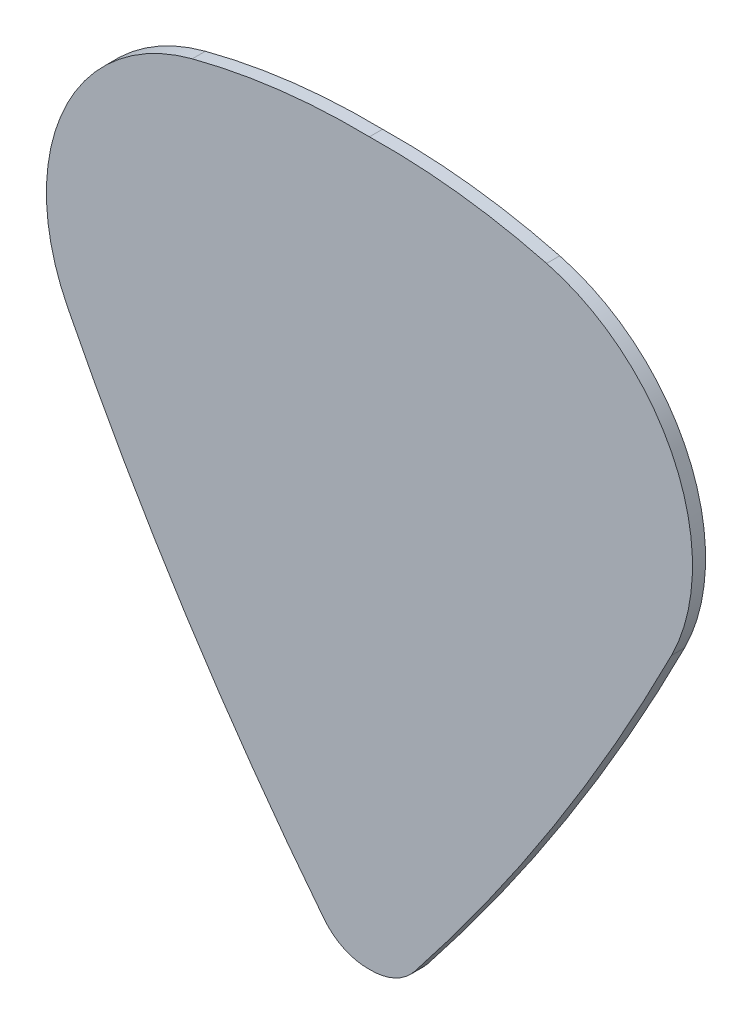
ISO-10303-21;
HEADER;
FILE_DESCRIPTION(('STEP AP214'),'2;1');
FILE_NAME('part.step','',(''),(''),'','','');
FILE_SCHEMA(('AUTOMOTIVE_DESIGN { 1 0 10303 214 1 1 1 1 }'));
ENDSEC;
DATA;
#1=APPLICATION_CONTEXT('core data for automotive mechanical design processes');
#2=APPLICATION_PROTOCOL_DEFINITION('international standard','automotive_design',2000,#1);
#3=PRODUCT_CONTEXT('',#1,'mechanical');
#4=PRODUCT('Part','Part','',(#3));
#5=PRODUCT_RELATED_PRODUCT_CATEGORY('part','',(#4));
#6=PRODUCT_DEFINITION_FORMATION('','',#4);
#7=PRODUCT_DEFINITION_CONTEXT('part definition',#1,'design');
#8=PRODUCT_DEFINITION('design','',#6,#7);
#9=PRODUCT_DEFINITION_SHAPE('','',#8);
#10=(LENGTH_UNIT() NAMED_UNIT(*) SI_UNIT(.MILLI.,.METRE.));
#11=(NAMED_UNIT(*) PLANE_ANGLE_UNIT() SI_UNIT($,.RADIAN.));
#12=(NAMED_UNIT(*) SI_UNIT($,.STERADIAN.) SOLID_ANGLE_UNIT());
#13=UNCERTAINTY_MEASURE_WITH_UNIT(LENGTH_MEASURE(1.E-05),#10,'distance_accuracy_value','');
#14=(GEOMETRIC_REPRESENTATION_CONTEXT(3) GLOBAL_UNCERTAINTY_ASSIGNED_CONTEXT((#13)) GLOBAL_UNIT_ASSIGNED_CONTEXT((#10,
#11,#12)) REPRESENTATION_CONTEXT('',''));
#15=CARTESIAN_POINT('',(0.,0.,0.));
#16=DIRECTION('',(0.,0.,1.));
#17=DIRECTION('',(1.,0.,0.));
#18=AXIS2_PLACEMENT_3D('',#15,#16,#17);
#19=CARTESIAN_POINT('',(0.583389971777569,-13.555034713092,0.6));
#20=DIRECTION('',(0.,0.,-1.));
#21=DIRECTION('',(-1.,0.,0.));
#22=AXIS2_PLACEMENT_3D('',#19,#20,#21);
#23=CYLINDRICAL_SURFACE('',#22,29.7180994700104);
#24=CARTESIAN_POINT('',(0.583389971777569,-13.555034713092,0.));
#25=DIRECTION('',(0.,0.,1.));
#26=DIRECTION('',(1.,0.,0.));
#27=AXIS2_PLACEMENT_3D('',#24,#25,#26);
#28=CIRCLE('',#27,29.7180994700104);
#29=CARTESIAN_POINT('',(8.10642740287265,15.1950843113533,0.));
#30=VERTEX_POINT('',#29);
#31=CARTESIAN_POINT('',(0.,16.1573380001442,0.));
#32=VERTEX_POINT('',#31);
#33=EDGE_CURVE('E128',#30,#32,#28,.T.);
#34=ORIENTED_EDGE('',*,*,#33,.T.);
#35=DIRECTION('',(0.,0.,-1.));
#36=VECTOR('',#35,1.);
#37=CARTESIAN_POINT('',(0.,16.1573380001442,0.6));
#38=LINE('',#37,#36);
#39=CARTESIAN_POINT('',(0.,16.1573380001442,0.6));
#40=VERTEX_POINT('',#39);
#41=EDGE_CURVE('E11',#40,#32,#38,.T.);
#42=ORIENTED_EDGE('',*,*,#41,.F.);
#43=CARTESIAN_POINT('',(0.583389971777569,-13.555034713092,0.6));
#44=DIRECTION('',(0.,0.,1.));
#45=DIRECTION('',(1.,0.,0.));
#46=AXIS2_PLACEMENT_3D('',#43,#44,#45);
#47=CIRCLE('',#46,29.7180994700104);
#48=CARTESIAN_POINT('',(8.10642740287265,15.1950843113533,0.6));
#49=VERTEX_POINT('',#48);
#50=EDGE_CURVE('E142',#49,#40,#47,.T.);
#51=ORIENTED_EDGE('',*,*,#50,.F.);
#52=DIRECTION('',(0.,0.,-1.));
#53=VECTOR('',#52,1.);
#54=CARTESIAN_POINT('',(8.10642740287265,15.1950843113533,0.6));
#55=LINE('',#54,#53);
#56=EDGE_CURVE('E124',#49,#30,#55,.T.);
#57=ORIENTED_EDGE('',*,*,#56,.T.);
#58=EDGE_LOOP('',(#34,#42,#51,#57));
#59=FACE_BOUND('',#58,.T.);
#60=ADVANCED_FACE('F32',(#59),#23,.T.);
#61=CARTESIAN_POINT('',(-0.583389971777569,-13.555034713092,0.6));
#62=DIRECTION('',(0.,0.,-1.));
#63=DIRECTION('',(-1.,0.,0.));
#64=AXIS2_PLACEMENT_3D('',#61,#62,#63);
#65=CYLINDRICAL_SURFACE('',#64,29.7180994700104);
#66=CARTESIAN_POINT('',(-0.583389971777569,-13.555034713092,0.));
#67=DIRECTION('',(0.,0.,1.));
#68=DIRECTION('',(-1.,0.,0.));
#69=AXIS2_PLACEMENT_3D('',#66,#67,#68);
#70=CIRCLE('',#69,29.7180994700104);
#71=CARTESIAN_POINT('',(-8.10642740287265,15.1950843113533,0.));
#72=VERTEX_POINT('',#71);
#73=EDGE_CURVE('E131',#32,#72,#70,.T.);
#74=ORIENTED_EDGE('',*,*,#73,.T.);
#75=DIRECTION('',(0.,0.,-1.));
#76=VECTOR('',#75,1.);
#77=CARTESIAN_POINT('',(-8.10642740287265,15.1950843113533,0.6));
#78=LINE('',#77,#76);
#79=CARTESIAN_POINT('',(-8.10642740287265,15.1950843113533,0.6));
#80=VERTEX_POINT('',#79);
#81=EDGE_CURVE('E40',#80,#72,#78,.T.);
#82=ORIENTED_EDGE('',*,*,#81,.F.);
#83=CARTESIAN_POINT('',(-0.583389971777569,-13.555034713092,0.6));
#84=DIRECTION('',(0.,0.,1.));
#85=DIRECTION('',(-1.,0.,0.));
#86=AXIS2_PLACEMENT_3D('',#83,#84,#85);
#87=CIRCLE('',#86,29.7180994700104);
#88=EDGE_CURVE('E91',#40,#80,#87,.T.);
#89=ORIENTED_EDGE('',*,*,#88,.F.);
#90=ORIENTED_EDGE('',*,*,#41,.T.);
#91=EDGE_LOOP('',(#74,#82,#89,#90));
#92=FACE_BOUND('',#91,.T.);
#93=ADVANCED_FACE('F177',(#92),#65,.T.);
#94=CARTESIAN_POINT('',(-5.84400110519622,6.54897216077692,0.6));
#95=DIRECTION('',(0.,0.,-1.));
#96=DIRECTION('',(-1.,0.,0.));
#97=AXIS2_PLACEMENT_3D('',#94,#95,#96);
#98=CYLINDRICAL_SURFACE('',#97,8.93721590165321);
#99=CARTESIAN_POINT('',(-5.84400110519622,6.54897216077692,0.));
#100=DIRECTION('',(0.,0.,1.));
#101=DIRECTION('',(-1.,0.,0.));
#102=AXIS2_PLACEMENT_3D('',#99,#100,#101);
#103=CIRCLE('',#102,8.93721590165321);
#104=CARTESIAN_POINT('',(-13.8206795806225,2.51828629204009,0.));
#105=VERTEX_POINT('',#104);
#106=EDGE_CURVE('E133',#72,#105,#103,.T.);
#107=ORIENTED_EDGE('',*,*,#106,.T.);
#108=DIRECTION('',(0.,0.,-1.));
#109=VECTOR('',#108,1.);
#110=CARTESIAN_POINT('',(-13.8206795806225,2.51828629204009,0.6));
#111=LINE('',#110,#109);
#112=CARTESIAN_POINT('',(-13.8206795806225,2.51828629204009,0.6));
#113=VERTEX_POINT('',#112);
#114=EDGE_CURVE('E149',#113,#105,#111,.T.);
#115=ORIENTED_EDGE('',*,*,#114,.F.);
#116=CARTESIAN_POINT('',(-5.84400110519622,6.54897216077692,0.6));
#117=DIRECTION('',(0.,0.,1.));
#118=DIRECTION('',(-1.,0.,0.));
#119=AXIS2_PLACEMENT_3D('',#116,#117,#118);
#120=CIRCLE('',#119,8.93721590165321);
#121=EDGE_CURVE('E157',#80,#113,#120,.T.);
#122=ORIENTED_EDGE('',*,*,#121,.F.);
#123=ORIENTED_EDGE('',*,*,#81,.T.);
#124=EDGE_LOOP('',(#107,#115,#122,#123));
#125=FACE_BOUND('',#124,.T.);
#126=ADVANCED_FACE('F155',(#125),#98,.T.);
#127=CARTESIAN_POINT('',(83.1995989065753,51.5434872806461,0.6));
#128=DIRECTION('',(0.,0.,-1.));
#129=DIRECTION('',(-1.,0.,0.));
#130=AXIS2_PLACEMENT_3D('',#127,#128,#129);
#131=CYLINDRICAL_SURFACE('',#130,108.703287759417);
#132=CARTESIAN_POINT('',(83.1995989065753,51.5434872806461,0.));
#133=DIRECTION('',(0.,0.,1.));
#134=DIRECTION('',(1.,0.,0.));
#135=AXIS2_PLACEMENT_3D('',#132,#133,#134);
#136=CIRCLE('',#135,108.703287759417);
#137=CARTESIAN_POINT('',(-2.07422362726388,-15.8714959217098,0.));
#138=VERTEX_POINT('',#137);
#139=EDGE_CURVE('E135',#105,#138,#136,.T.);
#140=ORIENTED_EDGE('',*,*,#139,.T.);
#141=DIRECTION('',(0.,0.,-1.));
#142=VECTOR('',#141,1.);
#143=CARTESIAN_POINT('',(-2.07422362726388,-15.8714959217098,0.6));
#144=LINE('',#143,#142);
#145=CARTESIAN_POINT('',(-2.07422362726388,-15.8714959217098,0.6));
#146=VERTEX_POINT('',#145);
#147=EDGE_CURVE('E146',#146,#138,#144,.T.);
#148=ORIENTED_EDGE('',*,*,#147,.F.);
#149=CARTESIAN_POINT('',(83.1995989065753,51.5434872806461,0.6));
#150=DIRECTION('',(0.,0.,1.));
#151=DIRECTION('',(1.,0.,0.));
#152=AXIS2_PLACEMENT_3D('',#149,#150,#151);
#153=CIRCLE('',#152,108.703287759417);
#154=EDGE_CURVE('E169',#113,#146,#153,.T.);
#155=ORIENTED_EDGE('',*,*,#154,.F.);
#156=ORIENTED_EDGE('',*,*,#114,.T.);
#157=EDGE_LOOP('',(#140,#148,#155,#156));
#158=FACE_BOUND('',#157,.T.);
#159=ADVANCED_FACE('F165',(#158),#131,.T.);
#160=CARTESIAN_POINT('',(-0.0816849129305678,-14.2962532509181,0.6));
#161=DIRECTION('',(0.,0.,-1.));
#162=DIRECTION('',(-1.,0.,0.));
#163=AXIS2_PLACEMENT_3D('',#160,#161,#162);
#164=CYLINDRICAL_SURFACE('',#163,2.54);
#165=CARTESIAN_POINT('',(-0.0816849129305678,-14.2962532509181,0.));
#166=DIRECTION('',(0.,0.,1.));
#167=DIRECTION('',(1.,0.,0.));
#168=AXIS2_PLACEMENT_3D('',#165,#166,#167);
#169=CIRCLE('',#168,2.54);
#170=CARTESIAN_POINT('',(0.,-16.8349394416474,0.));
#171=VERTEX_POINT('',#170);
#172=EDGE_CURVE('E137',#138,#171,#169,.T.);
#173=ORIENTED_EDGE('',*,*,#172,.T.);
#174=DIRECTION('',(0.,0.,-1.));
#175=VECTOR('',#174,1.);
#176=CARTESIAN_POINT('',(0.,-16.8349394416474,0.6));
#177=LINE('',#176,#175);
#178=CARTESIAN_POINT('',(0.,-16.8349394416474,0.6));
#179=VERTEX_POINT('',#178);
#180=EDGE_CURVE('E119',#179,#171,#177,.T.);
#181=ORIENTED_EDGE('',*,*,#180,.F.);
#182=CARTESIAN_POINT('',(-0.0816849129305678,-14.2962532509181,0.6));
#183=DIRECTION('',(0.,0.,1.));
#184=DIRECTION('',(1.,0.,0.));
#185=AXIS2_PLACEMENT_3D('',#182,#183,#184);
#186=CIRCLE('',#185,2.54);
#187=EDGE_CURVE('E110',#146,#179,#186,.T.);
#188=ORIENTED_EDGE('',*,*,#187,.F.);
#189=ORIENTED_EDGE('',*,*,#147,.T.);
#190=EDGE_LOOP('',(#173,#181,#188,#189));
#191=FACE_BOUND('',#190,.T.);
#192=ADVANCED_FACE('F168',(#191),#164,.T.);
#193=CARTESIAN_POINT('',(0.0816849129305678,-14.2962532509181,0.6));
#194=DIRECTION('',(0.,0.,-1.));
#195=DIRECTION('',(-1.,0.,0.));
#196=AXIS2_PLACEMENT_3D('',#193,#194,#195);
#197=CYLINDRICAL_SURFACE('',#196,2.54);
#198=CARTESIAN_POINT('',(0.0816849129305678,-14.2962532509181,0.));
#199=DIRECTION('',(0.,0.,1.));
#200=DIRECTION('',(-1.,0.,0.));
#201=AXIS2_PLACEMENT_3D('',#198,#199,#200);
#202=CIRCLE('',#201,2.54);
#203=CARTESIAN_POINT('',(2.07422362726387,-15.8714959217098,0.));
#204=VERTEX_POINT('',#203);
#205=EDGE_CURVE('E118',#171,#204,#202,.T.);
#206=ORIENTED_EDGE('',*,*,#205,.T.);
#207=DIRECTION('',(0.,0.,-1.));
#208=VECTOR('',#207,1.);
#209=CARTESIAN_POINT('',(2.07422362726387,-15.8714959217098,0.6));
#210=LINE('',#209,#208);
#211=CARTESIAN_POINT('',(2.07422362726387,-15.8714959217098,0.6));
#212=VERTEX_POINT('',#211);
#213=EDGE_CURVE('E115',#212,#204,#210,.T.);
#214=ORIENTED_EDGE('',*,*,#213,.F.);
#215=CARTESIAN_POINT('',(0.0816849129305678,-14.2962532509181,0.6));
#216=DIRECTION('',(0.,0.,1.));
#217=DIRECTION('',(-1.,0.,0.));
#218=AXIS2_PLACEMENT_3D('',#215,#216,#217);
#219=CIRCLE('',#218,2.54);
#220=EDGE_CURVE('E104',#179,#212,#219,.T.);
#221=ORIENTED_EDGE('',*,*,#220,.F.);
#222=ORIENTED_EDGE('',*,*,#180,.T.);
#223=EDGE_LOOP('',(#206,#214,#221,#222));
#224=FACE_BOUND('',#223,.T.);
#225=ADVANCED_FACE('F116',(#224),#197,.T.);
#226=CARTESIAN_POINT('',(-83.1995989065753,51.5434872806461,0.6));
#227=DIRECTION('',(0.,0.,-1.));
#228=DIRECTION('',(-1.,0.,0.));
#229=AXIS2_PLACEMENT_3D('',#226,#227,#228);
#230=CYLINDRICAL_SURFACE('',#229,108.703287759417);
#231=CARTESIAN_POINT('',(-83.1995989065753,51.5434872806461,0.));
#232=DIRECTION('',(0.,0.,1.));
#233=DIRECTION('',(-1.,0.,0.));
#234=AXIS2_PLACEMENT_3D('',#231,#232,#233);
#235=CIRCLE('',#234,108.703287759417);
#236=CARTESIAN_POINT('',(13.8206795806225,2.51828629204013,0.));
#237=VERTEX_POINT('',#236);
#238=EDGE_CURVE('E77',#204,#237,#235,.T.);
#239=ORIENTED_EDGE('',*,*,#238,.T.);
#240=DIRECTION('',(0.,0.,-1.));
#241=VECTOR('',#240,1.);
#242=CARTESIAN_POINT('',(13.8206795806225,2.51828629204013,0.6));
#243=LINE('',#242,#241);
#244=CARTESIAN_POINT('',(13.8206795806225,2.51828629204013,0.6));
#245=VERTEX_POINT('',#244);
#246=EDGE_CURVE('E120',#245,#237,#243,.T.);
#247=ORIENTED_EDGE('',*,*,#246,.F.);
#248=CARTESIAN_POINT('',(-83.1995989065753,51.5434872806461,0.6));
#249=DIRECTION('',(0.,0.,1.));
#250=DIRECTION('',(-1.,0.,0.));
#251=AXIS2_PLACEMENT_3D('',#248,#249,#250);
#252=CIRCLE('',#251,108.703287759417);
#253=EDGE_CURVE('E108',#212,#245,#252,.T.);
#254=ORIENTED_EDGE('',*,*,#253,.F.);
#255=ORIENTED_EDGE('',*,*,#213,.T.);
#256=EDGE_LOOP('',(#239,#247,#254,#255));
#257=FACE_BOUND('',#256,.T.);
#258=ADVANCED_FACE('F122',(#257),#230,.T.);
#259=CARTESIAN_POINT('',(5.84400110519622,6.54897216077692,0.6));
#260=DIRECTION('',(0.,0.,-1.));
#261=DIRECTION('',(-1.,0.,0.));
#262=AXIS2_PLACEMENT_3D('',#259,#260,#261);
#263=CYLINDRICAL_SURFACE('',#262,8.93721590165321);
#264=CARTESIAN_POINT('',(5.84400110519622,6.54897216077692,0.));
#265=DIRECTION('',(0.,0.,1.));
#266=DIRECTION('',(1.,0.,0.));
#267=AXIS2_PLACEMENT_3D('',#264,#265,#266);
#268=CIRCLE('',#267,8.93721590165321);
#269=EDGE_CURVE('E83',#237,#30,#268,.T.);
#270=ORIENTED_EDGE('',*,*,#269,.T.);
#271=ORIENTED_EDGE('',*,*,#56,.F.);
#272=CARTESIAN_POINT('',(5.84400110519622,6.54897216077692,0.6));
#273=DIRECTION('',(0.,0.,1.));
#274=DIRECTION('',(1.,0.,0.));
#275=AXIS2_PLACEMENT_3D('',#272,#273,#274);
#276=CIRCLE('',#275,8.93721590165321);
#277=EDGE_CURVE('E48',#245,#49,#276,.T.);
#278=ORIENTED_EDGE('',*,*,#277,.F.);
#279=ORIENTED_EDGE('',*,*,#246,.T.);
#280=EDGE_LOOP('',(#270,#271,#278,#279));
#281=FACE_BOUND('',#280,.T.);
#282=ADVANCED_FACE('F193',(#281),#263,.T.);
#283=CARTESIAN_POINT('',(0.,-13.555034713092,0.6));
#284=DIRECTION('',(0.,0.,1.));
#285=DIRECTION('',(1.,0.,0.));
#286=AXIS2_PLACEMENT_3D('',#283,#284,#285);
#287=PLANE('',#286);
#288=ORIENTED_EDGE('',*,*,#50,.T.);
#289=ORIENTED_EDGE('',*,*,#88,.T.);
#290=ORIENTED_EDGE('',*,*,#121,.T.);
#291=ORIENTED_EDGE('',*,*,#154,.T.);
#292=ORIENTED_EDGE('',*,*,#187,.T.);
#293=ORIENTED_EDGE('',*,*,#220,.T.);
#294=ORIENTED_EDGE('',*,*,#253,.T.);
#295=ORIENTED_EDGE('',*,*,#277,.T.);
#296=EDGE_LOOP('',(#288,#289,#290,#291,#292,#293,#294,#295));
#297=FACE_BOUND('',#296,.T.);
#298=ADVANCED_FACE('F106',(#297),#287,.T.);
#299=CARTESIAN_POINT('',(0.,-13.555034713092,0.));
#300=DIRECTION('',(0.,0.,1.));
#301=DIRECTION('',(1.,0.,0.));
#302=AXIS2_PLACEMENT_3D('',#299,#300,#301);
#303=PLANE('',#302);
#304=ORIENTED_EDGE('',*,*,#33,.F.);
#305=ORIENTED_EDGE('',*,*,#269,.F.);
#306=ORIENTED_EDGE('',*,*,#238,.F.);
#307=ORIENTED_EDGE('',*,*,#205,.F.);
#308=ORIENTED_EDGE('',*,*,#172,.F.);
#309=ORIENTED_EDGE('',*,*,#139,.F.);
#310=ORIENTED_EDGE('',*,*,#106,.F.);
#311=ORIENTED_EDGE('',*,*,#73,.F.);
#312=EDGE_LOOP('',(#304,#305,#306,#307,#308,#309,#310,#311));
#313=FACE_BOUND('',#312,.T.);
#314=ADVANCED_FACE('F161',(#313),#303,.F.);
#315=CLOSED_SHELL('',(#60,#93,#126,#159,#192,#225,#258,#282,#298,#314));
#316=MANIFOLD_SOLID_BREP('B2',#315);
#317=ADVANCED_BREP_SHAPE_REPRESENTATION('',(#18,#316),#14);
#318=SHAPE_DEFINITION_REPRESENTATION(#9,#317);
ENDSEC;
END-ISO-10303-21;
